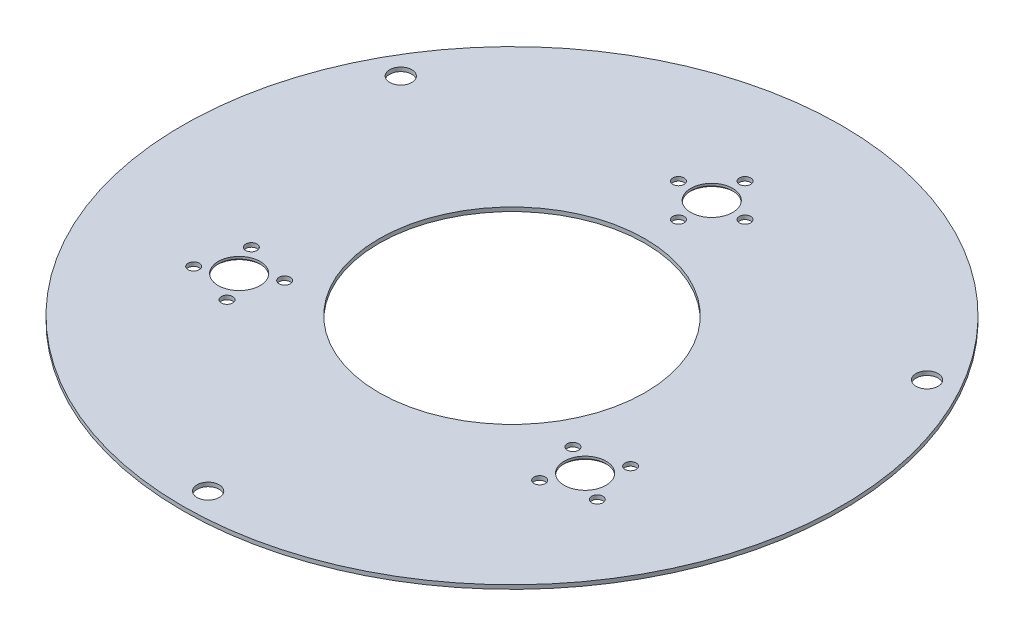
ISO-10303-21;
HEADER;
FILE_DESCRIPTION(('STEP AP214'),'2;1');
FILE_NAME('part.step','',(''),(''),'','','');
FILE_SCHEMA(('AUTOMOTIVE_DESIGN { 1 0 10303 214 1 1 1 1 }'));
ENDSEC;
DATA;
#1=APPLICATION_CONTEXT('core data for automotive mechanical design processes');
#2=APPLICATION_PROTOCOL_DEFINITION('international standard','automotive_design',2000,#1);
#3=PRODUCT_CONTEXT('',#1,'mechanical');
#4=PRODUCT('Part','Part','',(#3));
#5=PRODUCT_RELATED_PRODUCT_CATEGORY('part','',(#4));
#6=PRODUCT_DEFINITION_FORMATION('','',#4);
#7=PRODUCT_DEFINITION_CONTEXT('part definition',#1,'design');
#8=PRODUCT_DEFINITION('design','',#6,#7);
#9=PRODUCT_DEFINITION_SHAPE('','',#8);
#10=(LENGTH_UNIT() NAMED_UNIT(*) SI_UNIT(.MILLI.,.METRE.));
#11=(NAMED_UNIT(*) PLANE_ANGLE_UNIT() SI_UNIT($,.RADIAN.));
#12=(NAMED_UNIT(*) SI_UNIT($,.STERADIAN.) SOLID_ANGLE_UNIT());
#13=UNCERTAINTY_MEASURE_WITH_UNIT(LENGTH_MEASURE(1.E-05),#10,'distance_accuracy_value','');
#14=(GEOMETRIC_REPRESENTATION_CONTEXT(3) GLOBAL_UNCERTAINTY_ASSIGNED_CONTEXT((#13)) GLOBAL_UNIT_ASSIGNED_CONTEXT((#10,
#11,#12)) REPRESENTATION_CONTEXT('',''));
#15=CARTESIAN_POINT('',(0.,0.,0.));
#16=DIRECTION('',(0.,0.,1.));
#17=DIRECTION('',(1.,0.,0.));
#18=AXIS2_PLACEMENT_3D('',#15,#16,#17);
#19=CARTESIAN_POINT('',(0.,0.,0.));
#20=DIRECTION('',(0.,1.,0.));
#21=DIRECTION('',(0.,0.,1.));
#22=AXIS2_PLACEMENT_3D('',#19,#20,#21);
#23=PLANE('',#22);
#24=CARTESIAN_POINT('',(76.9896583964357,0.,44.4500000000014));
#25=DIRECTION('',(0.,-1.,0.));
#26=DIRECTION('',(0.,0.,-1.));
#27=AXIS2_PLACEMENT_3D('',#24,#25,#26);
#28=CIRCLE('',#27,2.15265000000001);
#29=CARTESIAN_POINT('',(76.9896583964357,0.,42.2973500000014));
#30=VERTEX_POINT('',#29);
#31=EDGE_CURVE('E174',#30,#30,#28,.T.);
#32=ORIENTED_EDGE('',*,*,#31,.F.);
#33=EDGE_LOOP('',(#32));
#34=FACE_BOUND('',#33,.T.);
#35=CARTESIAN_POINT('',(-12.6999999999989,0.,-76.2000000000001));
#36=DIRECTION('',(0.,-1.,0.));
#37=DIRECTION('',(0.,0.,-1.));
#38=AXIS2_PLACEMENT_3D('',#35,#36,#37);
#39=CIRCLE('',#38,2.15265);
#40=CARTESIAN_POINT('',(-12.6999999999989,0.,-78.3526500000001));
#41=VERTEX_POINT('',#40);
#42=EDGE_CURVE('E162',#41,#41,#39,.T.);
#43=ORIENTED_EDGE('',*,*,#42,.F.);
#44=EDGE_LOOP('',(#43));
#45=FACE_BOUND('',#44,.T.);
#46=CARTESIAN_POINT('',(12.7000000000011,0.,-76.1999999999999));
#47=DIRECTION('',(0.,-1.,0.));
#48=DIRECTION('',(0.,0.,-1.));
#49=AXIS2_PLACEMENT_3D('',#46,#47,#48);
#50=CIRCLE('',#49,2.15265);
#51=CARTESIAN_POINT('',(12.7000000000011,0.,-78.3526499999999));
#52=VERTEX_POINT('',#51);
#53=EDGE_CURVE('E150',#52,#52,#50,.T.);
#54=ORIENTED_EDGE('',*,*,#53,.F.);
#55=EDGE_LOOP('',(#54));
#56=FACE_BOUND('',#55,.T.);
#57=CARTESIAN_POINT('',(8.74300631892311E-13,0.,-63.5));
#58=DIRECTION('',(0.,-1.,0.));
#59=DIRECTION('',(0.,0.,-1.));
#60=AXIS2_PLACEMENT_3D('',#57,#58,#59);
#61=CIRCLE('',#60,2.15265);
#62=CARTESIAN_POINT('',(8.74300631892311E-13,0.,-65.65265));
#63=VERTEX_POINT('',#62);
#64=EDGE_CURVE('E138',#63,#63,#61,.T.);
#65=ORIENTED_EDGE('',*,*,#64,.F.);
#66=EDGE_LOOP('',(#65));
#67=FACE_BOUND('',#66,.T.);
#68=CARTESIAN_POINT('',(-72.3411357683745,0.,27.101477371937));
#69=DIRECTION('',(0.,-1.,0.));
#70=DIRECTION('',(0.,0.,-1.));
#71=AXIS2_PLACEMENT_3D('',#68,#69,#70);
#72=CIRCLE('',#71,2.15265000000001);
#73=CARTESIAN_POINT('',(-72.3411357683745,0.,24.948827371937));
#74=VERTEX_POINT('',#73);
#75=EDGE_CURVE('E120',#74,#74,#72,.T.);
#76=ORIENTED_EDGE('',*,*,#75,.F.);
#77=EDGE_LOOP('',(#76));
#78=FACE_BOUND('',#77,.T.);
#79=CARTESIAN_POINT('',(-54.9926131403121,0.,31.7499999999995));
#80=DIRECTION('',(0.,-1.,0.));
#81=DIRECTION('',(0.,0.,-1.));
#82=AXIS2_PLACEMENT_3D('',#79,#80,#81);
#83=CIRCLE('',#82,2.15265);
#84=CARTESIAN_POINT('',(-54.9926131403121,0.,29.5973499999995));
#85=VERTEX_POINT('',#84);
#86=EDGE_CURVE('E114',#85,#85,#83,.T.);
#87=ORIENTED_EDGE('',*,*,#86,.F.);
#88=EDGE_LOOP('',(#87));
#89=FACE_BOUND('',#88,.T.);
#90=CARTESIAN_POINT('',(-65.9911357683746,0.,38.0999999999994));
#91=DIRECTION('',(0.,1.,0.));
#92=DIRECTION('',(0.,0.,1.));
#93=AXIS2_PLACEMENT_3D('',#90,#91,#92);
#94=CIRCLE('',#93,8.62330000000003);
#95=CARTESIAN_POINT('',(-65.9911357683746,0.,46.7232999999994));
#96=VERTEX_POINT('',#95);
#97=EDGE_CURVE('E61',#96,#96,#94,.T.);
#98=ORIENTED_EDGE('',*,*,#97,.T.);
#99=EDGE_LOOP('',(#98));
#100=FACE_BOUND('',#99,.T.);
#101=CARTESIAN_POINT('',(0.,0.,-76.2));
#102=DIRECTION('',(0.,1.,0.));
#103=DIRECTION('',(0.,0.,1.));
#104=AXIS2_PLACEMENT_3D('',#101,#102,#103);
#105=CIRCLE('',#104,8.6233);
#106=CARTESIAN_POINT('',(0.,0.,-67.5767));
#107=VERTEX_POINT('',#106);
#108=EDGE_CURVE('E66',#107,#107,#105,.T.);
#109=ORIENTED_EDGE('',*,*,#108,.T.);
#110=EDGE_LOOP('',(#109));
#111=FACE_BOUND('',#110,.T.);
#112=CARTESIAN_POINT('',(65.9911357683741,0.,38.1000000000003));
#113=DIRECTION('',(0.,1.,0.));
#114=DIRECTION('',(0.,0.,1.));
#115=AXIS2_PLACEMENT_3D('',#112,#113,#114);
#116=CIRCLE('',#115,8.62330000000003);
#117=CARTESIAN_POINT('',(65.9911357683741,0.,46.7233000000003));
#118=VERTEX_POINT('',#117);
#119=EDGE_CURVE('E69',#118,#118,#116,.T.);
#120=ORIENTED_EDGE('',*,*,#119,.T.);
#121=EDGE_LOOP('',(#120));
#122=FACE_BOUND('',#121,.T.);
#123=CARTESIAN_POINT('',(100.394514548954,0.,-57.9627999999991));
#124=DIRECTION('',(0.,1.,0.));
#125=DIRECTION('',(0.,0.,1.));
#126=AXIS2_PLACEMENT_3D('',#123,#124,#125);
#127=CIRCLE('',#126,4.21639999999999);
#128=CARTESIAN_POINT('',(100.394514548954,0.,-53.7463999999991));
#129=VERTEX_POINT('',#128);
#130=EDGE_CURVE('E96',#129,#129,#127,.T.);
#131=ORIENTED_EDGE('',*,*,#130,.T.);
#132=EDGE_LOOP('',(#131));
#133=FACE_BOUND('',#132,.T.);
#134=CARTESIAN_POINT('',(-100.394514548953,0.,-57.9628000000005));
#135=DIRECTION('',(0.,1.,0.));
#136=DIRECTION('',(0.,0.,1.));
#137=AXIS2_PLACEMENT_3D('',#134,#135,#136);
#138=CIRCLE('',#137,4.21639999999999);
#139=CARTESIAN_POINT('',(-100.394514548953,0.,-53.7464000000005));
#140=VERTEX_POINT('',#139);
#141=EDGE_CURVE('E90',#140,#140,#138,.T.);
#142=ORIENTED_EDGE('',*,*,#141,.T.);
#143=EDGE_LOOP('',(#142));
#144=FACE_BOUND('',#143,.T.);
#145=CARTESIAN_POINT('',(0.,0.,115.9256));
#146=DIRECTION('',(0.,1.,0.));
#147=DIRECTION('',(0.,0.,1.));
#148=AXIS2_PLACEMENT_3D('',#145,#146,#147);
#149=CIRCLE('',#148,4.2164);
#150=CARTESIAN_POINT('',(0.,0.,120.142));
#151=VERTEX_POINT('',#150);
#152=EDGE_CURVE('E82',#151,#151,#149,.T.);
#153=ORIENTED_EDGE('',*,*,#152,.T.);
#154=EDGE_LOOP('',(#153));
#155=FACE_BOUND('',#154,.T.);
#156=CARTESIAN_POINT('',(0.,0.,0.));
#157=DIRECTION('',(0.,1.,0.));
#158=DIRECTION('',(0.,0.,1.));
#159=AXIS2_PLACEMENT_3D('',#156,#157,#158);
#160=CIRCLE('',#159,125.73);
#161=CARTESIAN_POINT('',(0.,0.,125.73));
#162=VERTEX_POINT('',#161);
#163=EDGE_CURVE('E73',#162,#162,#160,.T.);
#164=ORIENTED_EDGE('',*,*,#163,.F.);
#165=EDGE_LOOP('',(#164));
#166=FACE_BOUND('',#165,.T.);
#167=CARTESIAN_POINT('',(0.,0.,0.));
#168=DIRECTION('',(0.,1.,0.));
#169=DIRECTION('',(0.,0.,1.));
#170=AXIS2_PLACEMENT_3D('',#167,#168,#169);
#171=CIRCLE('',#170,50.8);
#172=CARTESIAN_POINT('',(0.,0.,50.8));
#173=VERTEX_POINT('',#172);
#174=EDGE_CURVE('E79',#173,#173,#171,.T.);
#175=ORIENTED_EDGE('',*,*,#174,.T.);
#176=EDGE_LOOP('',(#175));
#177=FACE_BOUND('',#176,.T.);
#178=CARTESIAN_POINT('',(-76.989658396437,0.,44.4499999999993));
#179=DIRECTION('',(0.,-1.,0.));
#180=DIRECTION('',(0.,0.,-1.));
#181=AXIS2_PLACEMENT_3D('',#178,#179,#180);
#182=CIRCLE('',#181,2.15265000000001);
#183=CARTESIAN_POINT('',(-76.989658396437,0.,42.2973499999993));
#184=VERTEX_POINT('',#183);
#185=EDGE_CURVE('E126',#184,#184,#182,.T.);
#186=ORIENTED_EDGE('',*,*,#185,.F.);
#187=EDGE_LOOP('',(#186));
#188=FACE_BOUND('',#187,.T.);
#189=CARTESIAN_POINT('',(-59.6411357683746,0.,49.0985226280617));
#190=DIRECTION('',(0.,-1.,0.));
#191=DIRECTION('',(0.,0.,-1.));
#192=AXIS2_PLACEMENT_3D('',#189,#190,#191);
#193=CIRCLE('',#192,2.15265);
#194=CARTESIAN_POINT('',(-59.6411357683746,0.,46.9458726280617));
#195=VERTEX_POINT('',#194);
#196=EDGE_CURVE('E132',#195,#195,#193,.T.);
#197=ORIENTED_EDGE('',*,*,#196,.F.);
#198=EDGE_LOOP('',(#197));
#199=FACE_BOUND('',#198,.T.);
#200=CARTESIAN_POINT('',(54.9926131403113,0.,31.750000000001));
#201=DIRECTION('',(0.,-1.,0.));
#202=DIRECTION('',(0.,0.,-1.));
#203=AXIS2_PLACEMENT_3D('',#200,#201,#202);
#204=CIRCLE('',#203,2.15265);
#205=CARTESIAN_POINT('',(54.9926131403113,0.,29.597350000001));
#206=VERTEX_POINT('',#205);
#207=EDGE_CURVE('E144',#206,#206,#204,.T.);
#208=ORIENTED_EDGE('',*,*,#207,.F.);
#209=EDGE_LOOP('',(#208));
#210=FACE_BOUND('',#209,.T.);
#211=CARTESIAN_POINT('',(1.23512311489549E-12,0.,-88.9));
#212=DIRECTION('',(0.,-1.,0.));
#213=DIRECTION('',(0.,0.,-1.));
#214=AXIS2_PLACEMENT_3D('',#211,#212,#213);
#215=CIRCLE('',#214,2.15265);
#216=CARTESIAN_POINT('',(1.23512311489549E-12,0.,-91.05265));
#217=VERTEX_POINT('',#216);
#218=EDGE_CURVE('E156',#217,#217,#215,.T.);
#219=ORIENTED_EDGE('',*,*,#218,.F.);
#220=EDGE_LOOP('',(#219));
#221=FACE_BOUND('',#220,.T.);
#222=CARTESIAN_POINT('',(59.6411357683733,0.,49.0985226280635));
#223=DIRECTION('',(0.,-1.,0.));
#224=DIRECTION('',(0.,0.,-1.));
#225=AXIS2_PLACEMENT_3D('',#222,#223,#224);
#226=CIRCLE('',#225,2.15265);
#227=CARTESIAN_POINT('',(59.6411357683733,0.,46.9458726280635));
#228=VERTEX_POINT('',#227);
#229=EDGE_CURVE('E168',#228,#228,#226,.T.);
#230=ORIENTED_EDGE('',*,*,#229,.F.);
#231=EDGE_LOOP('',(#230));
#232=FACE_BOUND('',#231,.T.);
#233=CARTESIAN_POINT('',(72.3411357683736,0.,27.1014773719389));
#234=DIRECTION('',(0.,-1.,0.));
#235=DIRECTION('',(0.,0.,-1.));
#236=AXIS2_PLACEMENT_3D('',#233,#234,#235);
#237=CIRCLE('',#236,2.15265000000001);
#238=CARTESIAN_POINT('',(72.3411357683736,0.,24.9488273719389));
#239=VERTEX_POINT('',#238);
#240=EDGE_CURVE('E180',#239,#239,#237,.T.);
#241=ORIENTED_EDGE('',*,*,#240,.F.);
#242=EDGE_LOOP('',(#241));
#243=FACE_BOUND('',#242,.T.);
#244=ADVANCED_FACE('F46',(#34,#45,#56,#67,#78,#89,#100,#111,#122,#133,#144,#155,#166,#177,#188,
#199,#210,#221,#232,#243),#23,.F.);
#245=CARTESIAN_POINT('',(0.,1.524,0.));
#246=DIRECTION('',(0.,1.,0.));
#247=DIRECTION('',(0.,0.,1.));
#248=AXIS2_PLACEMENT_3D('',#245,#246,#247);
#249=PLANE('',#248);
#250=CARTESIAN_POINT('',(76.9896583964357,1.524,44.4500000000014));
#251=DIRECTION('',(0.,-1.,0.));
#252=DIRECTION('',(0.,0.,-1.));
#253=AXIS2_PLACEMENT_3D('',#250,#251,#252);
#254=CIRCLE('',#253,2.15265000000001);
#255=CARTESIAN_POINT('',(76.9896583964357,1.524,42.2973500000014));
#256=VERTEX_POINT('',#255);
#257=EDGE_CURVE('E171',#256,#256,#254,.T.);
#258=ORIENTED_EDGE('',*,*,#257,.T.);
#259=EDGE_LOOP('',(#258));
#260=FACE_BOUND('',#259,.T.);
#261=CARTESIAN_POINT('',(-12.6999999999989,1.524,-76.2000000000001));
#262=DIRECTION('',(0.,-1.,0.));
#263=DIRECTION('',(0.,0.,-1.));
#264=AXIS2_PLACEMENT_3D('',#261,#262,#263);
#265=CIRCLE('',#264,2.15265);
#266=CARTESIAN_POINT('',(-12.6999999999989,1.524,-78.3526500000001));
#267=VERTEX_POINT('',#266);
#268=EDGE_CURVE('E159',#267,#267,#265,.T.);
#269=ORIENTED_EDGE('',*,*,#268,.T.);
#270=EDGE_LOOP('',(#269));
#271=FACE_BOUND('',#270,.T.);
#272=CARTESIAN_POINT('',(12.7000000000011,1.524,-76.1999999999999));
#273=DIRECTION('',(0.,-1.,0.));
#274=DIRECTION('',(0.,0.,-1.));
#275=AXIS2_PLACEMENT_3D('',#272,#273,#274);
#276=CIRCLE('',#275,2.15265);
#277=CARTESIAN_POINT('',(12.7000000000011,1.524,-78.3526499999999));
#278=VERTEX_POINT('',#277);
#279=EDGE_CURVE('E147',#278,#278,#276,.T.);
#280=ORIENTED_EDGE('',*,*,#279,.T.);
#281=EDGE_LOOP('',(#280));
#282=FACE_BOUND('',#281,.T.);
#283=CARTESIAN_POINT('',(8.74300631892311E-13,1.524,-63.5));
#284=DIRECTION('',(0.,-1.,0.));
#285=DIRECTION('',(0.,0.,-1.));
#286=AXIS2_PLACEMENT_3D('',#283,#284,#285);
#287=CIRCLE('',#286,2.15265);
#288=CARTESIAN_POINT('',(8.74300631892311E-13,1.524,-65.65265));
#289=VERTEX_POINT('',#288);
#290=EDGE_CURVE('E135',#289,#289,#287,.T.);
#291=ORIENTED_EDGE('',*,*,#290,.T.);
#292=EDGE_LOOP('',(#291));
#293=FACE_BOUND('',#292,.T.);
#294=CARTESIAN_POINT('',(0.,1.524,0.));
#295=DIRECTION('',(0.,1.,0.));
#296=DIRECTION('',(0.,0.,1.));
#297=AXIS2_PLACEMENT_3D('',#294,#295,#296);
#298=CIRCLE('',#297,50.8);
#299=CARTESIAN_POINT('',(0.,1.524,50.8));
#300=VERTEX_POINT('',#299);
#301=EDGE_CURVE('E76',#300,#300,#298,.T.);
#302=ORIENTED_EDGE('',*,*,#301,.F.);
#303=EDGE_LOOP('',(#302));
#304=FACE_BOUND('',#303,.T.);
#305=CARTESIAN_POINT('',(0.,1.524,0.));
#306=DIRECTION('',(0.,1.,0.));
#307=DIRECTION('',(0.,0.,1.));
#308=AXIS2_PLACEMENT_3D('',#305,#306,#307);
#309=CIRCLE('',#308,125.73);
#310=CARTESIAN_POINT('',(0.,1.524,125.73));
#311=VERTEX_POINT('',#310);
#312=EDGE_CURVE('E72',#311,#311,#309,.T.);
#313=ORIENTED_EDGE('',*,*,#312,.T.);
#314=EDGE_LOOP('',(#313));
#315=FACE_BOUND('',#314,.T.);
#316=CARTESIAN_POINT('',(0.,1.524,115.9256));
#317=DIRECTION('',(0.,1.,0.));
#318=DIRECTION('',(0.,0.,1.));
#319=AXIS2_PLACEMENT_3D('',#316,#317,#318);
#320=CIRCLE('',#319,4.21639999999999);
#321=CARTESIAN_POINT('',(0.,1.524,120.142));
#322=VERTEX_POINT('',#321);
#323=EDGE_CURVE('E87',#322,#322,#320,.T.);
#324=ORIENTED_EDGE('',*,*,#323,.F.);
#325=EDGE_LOOP('',(#324));
#326=FACE_BOUND('',#325,.T.);
#327=CARTESIAN_POINT('',(-100.394514548953,1.524,-57.9628000000005));
#328=DIRECTION('',(0.,1.,0.));
#329=DIRECTION('',(0.,0.,1.));
#330=AXIS2_PLACEMENT_3D('',#327,#328,#329);
#331=CIRCLE('',#330,4.21639999999998);
#332=CARTESIAN_POINT('',(-100.394514548953,1.524,-53.7464000000005));
#333=VERTEX_POINT('',#332);
#334=EDGE_CURVE('E93',#333,#333,#331,.T.);
#335=ORIENTED_EDGE('',*,*,#334,.F.);
#336=EDGE_LOOP('',(#335));
#337=FACE_BOUND('',#336,.T.);
#338=CARTESIAN_POINT('',(100.394514548954,1.524,-57.9627999999991));
#339=DIRECTION('',(0.,1.,0.));
#340=DIRECTION('',(0.,0.,1.));
#341=AXIS2_PLACEMENT_3D('',#338,#339,#340);
#342=CIRCLE('',#341,4.21639999999999);
#343=CARTESIAN_POINT('',(100.394514548954,1.524,-53.7463999999991));
#344=VERTEX_POINT('',#343);
#345=EDGE_CURVE('E99',#344,#344,#342,.T.);
#346=ORIENTED_EDGE('',*,*,#345,.F.);
#347=EDGE_LOOP('',(#346));
#348=FACE_BOUND('',#347,.T.);
#349=CARTESIAN_POINT('',(0.,1.524,-76.2));
#350=DIRECTION('',(0.,1.,0.));
#351=DIRECTION('',(0.,0.,1.));
#352=AXIS2_PLACEMENT_3D('',#349,#350,#351);
#353=CIRCLE('',#352,7.98830000000001);
#354=CARTESIAN_POINT('',(0.,1.524,-68.2117));
#355=VERTEX_POINT('',#354);
#356=EDGE_CURVE('E102',#355,#355,#353,.T.);
#357=ORIENTED_EDGE('',*,*,#356,.F.);
#358=EDGE_LOOP('',(#357));
#359=FACE_BOUND('',#358,.T.);
#360=CARTESIAN_POINT('',(65.9911357683741,1.524,38.1000000000003));
#361=DIRECTION('',(0.,1.,0.));
#362=DIRECTION('',(0.,0.,1.));
#363=AXIS2_PLACEMENT_3D('',#360,#361,#362);
#364=CIRCLE('',#363,7.98830000000002);
#365=CARTESIAN_POINT('',(65.9911357683741,1.524,46.0883000000003));
#366=VERTEX_POINT('',#365);
#367=EDGE_CURVE('E105',#366,#366,#364,.T.);
#368=ORIENTED_EDGE('',*,*,#367,.F.);
#369=EDGE_LOOP('',(#368));
#370=FACE_BOUND('',#369,.T.);
#371=CARTESIAN_POINT('',(-65.9911357683746,1.524,38.0999999999994));
#372=DIRECTION('',(0.,1.,0.));
#373=DIRECTION('',(0.,0.,1.));
#374=AXIS2_PLACEMENT_3D('',#371,#372,#373);
#375=CIRCLE('',#374,7.98830000000002);
#376=CARTESIAN_POINT('',(-65.9911357683746,1.524,46.0882999999994));
#377=VERTEX_POINT('',#376);
#378=EDGE_CURVE('E108',#377,#377,#375,.T.);
#379=ORIENTED_EDGE('',*,*,#378,.F.);
#380=EDGE_LOOP('',(#379));
#381=FACE_BOUND('',#380,.T.);
#382=CARTESIAN_POINT('',(-54.9926131403121,1.524,31.7499999999995));
#383=DIRECTION('',(0.,-1.,0.));
#384=DIRECTION('',(0.,0.,-1.));
#385=AXIS2_PLACEMENT_3D('',#382,#383,#384);
#386=CIRCLE('',#385,2.15265);
#387=CARTESIAN_POINT('',(-54.9926131403121,1.524,29.5973499999995));
#388=VERTEX_POINT('',#387);
#389=EDGE_CURVE('E111',#388,#388,#386,.T.);
#390=ORIENTED_EDGE('',*,*,#389,.T.);
#391=EDGE_LOOP('',(#390));
#392=FACE_BOUND('',#391,.T.);
#393=CARTESIAN_POINT('',(-72.3411357683745,1.524,27.101477371937));
#394=DIRECTION('',(0.,-1.,0.));
#395=DIRECTION('',(0.,0.,-1.));
#396=AXIS2_PLACEMENT_3D('',#393,#394,#395);
#397=CIRCLE('',#396,2.15265000000001);
#398=CARTESIAN_POINT('',(-72.3411357683745,1.524,24.948827371937));
#399=VERTEX_POINT('',#398);
#400=EDGE_CURVE('E117',#399,#399,#397,.T.);
#401=ORIENTED_EDGE('',*,*,#400,.T.);
#402=EDGE_LOOP('',(#401));
#403=FACE_BOUND('',#402,.T.);
#404=CARTESIAN_POINT('',(-76.989658396437,1.524,44.4499999999993));
#405=DIRECTION('',(0.,-1.,0.));
#406=DIRECTION('',(0.,0.,-1.));
#407=AXIS2_PLACEMENT_3D('',#404,#405,#406);
#408=CIRCLE('',#407,2.15265000000001);
#409=CARTESIAN_POINT('',(-76.989658396437,1.524,42.2973499999993));
#410=VERTEX_POINT('',#409);
#411=EDGE_CURVE('E123',#410,#410,#408,.T.);
#412=ORIENTED_EDGE('',*,*,#411,.T.);
#413=EDGE_LOOP('',(#412));
#414=FACE_BOUND('',#413,.T.);
#415=CARTESIAN_POINT('',(-59.6411357683746,1.524,49.0985226280617));
#416=DIRECTION('',(0.,-1.,0.));
#417=DIRECTION('',(0.,0.,-1.));
#418=AXIS2_PLACEMENT_3D('',#415,#416,#417);
#419=CIRCLE('',#418,2.15265);
#420=CARTESIAN_POINT('',(-59.6411357683746,1.524,46.9458726280617));
#421=VERTEX_POINT('',#420);
#422=EDGE_CURVE('E129',#421,#421,#419,.T.);
#423=ORIENTED_EDGE('',*,*,#422,.T.);
#424=EDGE_LOOP('',(#423));
#425=FACE_BOUND('',#424,.T.);
#426=CARTESIAN_POINT('',(54.9926131403113,1.524,31.750000000001));
#427=DIRECTION('',(0.,-1.,0.));
#428=DIRECTION('',(0.,0.,-1.));
#429=AXIS2_PLACEMENT_3D('',#426,#427,#428);
#430=CIRCLE('',#429,2.15265);
#431=CARTESIAN_POINT('',(54.9926131403113,1.524,29.597350000001));
#432=VERTEX_POINT('',#431);
#433=EDGE_CURVE('E141',#432,#432,#430,.T.);
#434=ORIENTED_EDGE('',*,*,#433,.T.);
#435=EDGE_LOOP('',(#434));
#436=FACE_BOUND('',#435,.T.);
#437=CARTESIAN_POINT('',(1.23512311489549E-12,1.524,-88.9));
#438=DIRECTION('',(0.,-1.,0.));
#439=DIRECTION('',(0.,0.,-1.));
#440=AXIS2_PLACEMENT_3D('',#437,#438,#439);
#441=CIRCLE('',#440,2.15265);
#442=CARTESIAN_POINT('',(1.23512311489549E-12,1.524,-91.05265));
#443=VERTEX_POINT('',#442);
#444=EDGE_CURVE('E153',#443,#443,#441,.T.);
#445=ORIENTED_EDGE('',*,*,#444,.T.);
#446=EDGE_LOOP('',(#445));
#447=FACE_BOUND('',#446,.T.);
#448=CARTESIAN_POINT('',(59.6411357683733,1.524,49.0985226280635));
#449=DIRECTION('',(0.,-1.,0.));
#450=DIRECTION('',(0.,0.,-1.));
#451=AXIS2_PLACEMENT_3D('',#448,#449,#450);
#452=CIRCLE('',#451,2.15265);
#453=CARTESIAN_POINT('',(59.6411357683733,1.524,46.9458726280635));
#454=VERTEX_POINT('',#453);
#455=EDGE_CURVE('E165',#454,#454,#452,.T.);
#456=ORIENTED_EDGE('',*,*,#455,.T.);
#457=EDGE_LOOP('',(#456));
#458=FACE_BOUND('',#457,.T.);
#459=CARTESIAN_POINT('',(72.3411357683736,1.524,27.1014773719389));
#460=DIRECTION('',(0.,-1.,0.));
#461=DIRECTION('',(0.,0.,-1.));
#462=AXIS2_PLACEMENT_3D('',#459,#460,#461);
#463=CIRCLE('',#462,2.15265000000001);
#464=CARTESIAN_POINT('',(72.3411357683736,1.524,24.9488273719389));
#465=VERTEX_POINT('',#464);
#466=EDGE_CURVE('E177',#465,#465,#463,.T.);
#467=ORIENTED_EDGE('',*,*,#466,.T.);
#468=EDGE_LOOP('',(#467));
#469=FACE_BOUND('',#468,.T.);
#470=ADVANCED_FACE('F187',(#260,#271,#282,#293,#304,#315,#326,#337,#348,#359,#370,#381,#392,
#403,#414,#425,#436,#447,#458,#469),#249,.T.);
#471=CARTESIAN_POINT('',(0.,1.524,0.));
#472=DIRECTION('',(0.,-1.,0.));
#473=DIRECTION('',(0.,0.,-1.));
#474=AXIS2_PLACEMENT_3D('',#471,#472,#473);
#475=CYLINDRICAL_SURFACE('',#474,125.73);
#476=ORIENTED_EDGE('',*,*,#312,.F.);
#477=EDGE_LOOP('',(#476));
#478=FACE_BOUND('',#477,.T.);
#479=ORIENTED_EDGE('',*,*,#163,.T.);
#480=EDGE_LOOP('',(#479));
#481=FACE_BOUND('',#480,.T.);
#482=ADVANCED_FACE('F193',(#478,#481),#475,.T.);
#483=CARTESIAN_POINT('',(0.,1.524,0.));
#484=DIRECTION('',(0.,-1.,0.));
#485=DIRECTION('',(0.,0.,-1.));
#486=AXIS2_PLACEMENT_3D('',#483,#484,#485);
#487=CYLINDRICAL_SURFACE('',#486,50.8);
#488=ORIENTED_EDGE('',*,*,#301,.T.);
#489=EDGE_LOOP('',(#488));
#490=FACE_BOUND('',#489,.T.);
#491=ORIENTED_EDGE('',*,*,#174,.F.);
#492=EDGE_LOOP('',(#491));
#493=FACE_BOUND('',#492,.T.);
#494=ADVANCED_FACE('F202',(#490,#493),#487,.F.);
#495=CARTESIAN_POINT('',(0.,1.524,115.9256));
#496=DIRECTION('',(0.,1.,0.));
#497=DIRECTION('',(0.,0.,1.));
#498=AXIS2_PLACEMENT_3D('',#495,#496,#497);
#499=CYLINDRICAL_SURFACE('',#498,4.21639999999999);
#500=ORIENTED_EDGE('',*,*,#152,.F.);
#501=EDGE_LOOP('',(#500));
#502=FACE_BOUND('',#501,.T.);
#503=ORIENTED_EDGE('',*,*,#323,.T.);
#504=EDGE_LOOP('',(#503));
#505=FACE_BOUND('',#504,.T.);
#506=ADVANCED_FACE('F306',(#502,#505),#499,.F.);
#507=CARTESIAN_POINT('',(-100.394514548953,1.524,-57.9628000000005));
#508=DIRECTION('',(0.,1.,0.));
#509=DIRECTION('',(0.,0.,1.));
#510=AXIS2_PLACEMENT_3D('',#507,#508,#509);
#511=CYLINDRICAL_SURFACE('',#510,4.21639999999999);
#512=ORIENTED_EDGE('',*,*,#141,.F.);
#513=EDGE_LOOP('',(#512));
#514=FACE_BOUND('',#513,.T.);
#515=ORIENTED_EDGE('',*,*,#334,.T.);
#516=EDGE_LOOP('',(#515));
#517=FACE_BOUND('',#516,.T.);
#518=ADVANCED_FACE('F302',(#514,#517),#511,.F.);
#519=CARTESIAN_POINT('',(100.394514548954,1.524,-57.9627999999991));
#520=DIRECTION('',(0.,1.,0.));
#521=DIRECTION('',(0.,0.,1.));
#522=AXIS2_PLACEMENT_3D('',#519,#520,#521);
#523=CYLINDRICAL_SURFACE('',#522,4.21639999999999);
#524=ORIENTED_EDGE('',*,*,#130,.F.);
#525=EDGE_LOOP('',(#524));
#526=FACE_BOUND('',#525,.T.);
#527=ORIENTED_EDGE('',*,*,#345,.T.);
#528=EDGE_LOOP('',(#527));
#529=FACE_BOUND('',#528,.T.);
#530=ADVANCED_FACE('F299',(#526,#529),#523,.F.);
#531=CARTESIAN_POINT('',(0.,1.524,-76.2));
#532=DIRECTION('',(0.,1.,0.));
#533=DIRECTION('',(0.,0.,1.));
#534=AXIS2_PLACEMENT_3D('',#531,#532,#533);
#535=CYLINDRICAL_SURFACE('',#534,7.98830000000001);
#536=CARTESIAN_POINT('',(0.,0.63499999999996,-76.2));
#537=DIRECTION('',(0.,1.,0.));
#538=DIRECTION('',(0.,0.,1.));
#539=AXIS2_PLACEMENT_3D('',#536,#537,#538);
#540=CIRCLE('',#539,7.98830000000001);
#541=CARTESIAN_POINT('',(0.,0.63499999999996,-68.2117));
#542=VERTEX_POINT('',#541);
#543=EDGE_CURVE('E53',#542,#542,#540,.F.);
#544=ORIENTED_EDGE('',*,*,#543,.T.);
#545=EDGE_LOOP('',(#544));
#546=FACE_BOUND('',#545,.T.);
#547=ORIENTED_EDGE('',*,*,#356,.T.);
#548=EDGE_LOOP('',(#547));
#549=FACE_BOUND('',#548,.T.);
#550=ADVANCED_FACE('F296',(#546,#549),#535,.F.);
#551=CARTESIAN_POINT('',(65.9911357683741,1.524,38.1000000000003));
#552=DIRECTION('',(0.,1.,0.));
#553=DIRECTION('',(0.,0.,1.));
#554=AXIS2_PLACEMENT_3D('',#551,#552,#553);
#555=CYLINDRICAL_SURFACE('',#554,7.98830000000001);
#556=CARTESIAN_POINT('',(65.9911357683741,0.635000000000014,38.1000000000003));
#557=DIRECTION('',(0.,1.,0.));
#558=DIRECTION('',(0.,0.,1.));
#559=AXIS2_PLACEMENT_3D('',#556,#557,#558);
#560=CIRCLE('',#559,7.98830000000001);
#561=CARTESIAN_POINT('',(65.9911357683741,0.635000000000014,46.0883000000003));
#562=VERTEX_POINT('',#561);
#563=EDGE_CURVE('E12',#562,#562,#560,.F.);
#564=ORIENTED_EDGE('',*,*,#563,.T.);
#565=EDGE_LOOP('',(#564));
#566=FACE_BOUND('',#565,.T.);
#567=ORIENTED_EDGE('',*,*,#367,.T.);
#568=EDGE_LOOP('',(#567));
#569=FACE_BOUND('',#568,.T.);
#570=ADVANCED_FACE('F292',(#566,#569),#555,.F.);
#571=CARTESIAN_POINT('',(-65.9911357683746,1.524,38.0999999999994));
#572=DIRECTION('',(0.,1.,0.));
#573=DIRECTION('',(0.,0.,1.));
#574=AXIS2_PLACEMENT_3D('',#571,#572,#573);
#575=CYLINDRICAL_SURFACE('',#574,7.98830000000001);
#576=CARTESIAN_POINT('',(-65.9911357683746,0.635000000000009,38.0999999999994));
#577=DIRECTION('',(0.,1.,0.));
#578=DIRECTION('',(0.,0.,1.));
#579=AXIS2_PLACEMENT_3D('',#576,#577,#578);
#580=CIRCLE('',#579,7.98830000000001);
#581=CARTESIAN_POINT('',(-65.9911357683746,0.635000000000009,46.0882999999994));
#582=VERTEX_POINT('',#581);
#583=EDGE_CURVE('E57',#582,#582,#580,.F.);
#584=ORIENTED_EDGE('',*,*,#583,.T.);
#585=EDGE_LOOP('',(#584));
#586=FACE_BOUND('',#585,.T.);
#587=ORIENTED_EDGE('',*,*,#378,.T.);
#588=EDGE_LOOP('',(#587));
#589=FACE_BOUND('',#588,.T.);
#590=ADVANCED_FACE('F207',(#586,#589),#575,.F.);
#591=CARTESIAN_POINT('',(-65.9911357683746,0.,38.0999999999994));
#592=DIRECTION('',(0.,-1.,0.));
#593=DIRECTION('',(0.,0.,-1.));
#594=AXIS2_PLACEMENT_3D('',#591,#592,#593);
#595=CONICAL_SURFACE('',#594,8.62330000000003,0.785398163397452);
#596=ORIENTED_EDGE('',*,*,#583,.F.);
#597=EDGE_LOOP('',(#596));
#598=FACE_BOUND('',#597,.T.);
#599=ORIENTED_EDGE('',*,*,#97,.F.);
#600=EDGE_LOOP('',(#599));
#601=FACE_BOUND('',#600,.T.);
#602=ADVANCED_FACE('F204',(#598,#601),#595,.F.);
#603=CARTESIAN_POINT('',(0.,0.,-76.2));
#604=DIRECTION('',(0.,-1.,0.));
#605=DIRECTION('',(0.,0.,-1.));
#606=AXIS2_PLACEMENT_3D('',#603,#604,#605);
#607=CONICAL_SURFACE('',#606,8.6233,0.78539816339747);
#608=ORIENTED_EDGE('',*,*,#543,.F.);
#609=EDGE_LOOP('',(#608));
#610=FACE_BOUND('',#609,.T.);
#611=ORIENTED_EDGE('',*,*,#108,.F.);
#612=EDGE_LOOP('',(#611));
#613=FACE_BOUND('',#612,.T.);
#614=ADVANCED_FACE('F206',(#610,#613),#607,.F.);
#615=CARTESIAN_POINT('',(65.9911357683741,0.,38.1000000000003));
#616=DIRECTION('',(0.,-1.,0.));
#617=DIRECTION('',(0.,0.,-1.));
#618=AXIS2_PLACEMENT_3D('',#615,#616,#617);
#619=CONICAL_SURFACE('',#618,8.62330000000003,0.785398163397451);
#620=ORIENTED_EDGE('',*,*,#563,.F.);
#621=EDGE_LOOP('',(#620));
#622=FACE_BOUND('',#621,.T.);
#623=ORIENTED_EDGE('',*,*,#119,.F.);
#624=EDGE_LOOP('',(#623));
#625=FACE_BOUND('',#624,.T.);
#626=ADVANCED_FACE('F48',(#622,#625),#619,.F.);
#627=CARTESIAN_POINT('',(-54.9926131403121,0.,31.7499999999995));
#628=DIRECTION('',(0.,-1.,0.));
#629=DIRECTION('',(0.,0.,-1.));
#630=AXIS2_PLACEMENT_3D('',#627,#628,#629);
#631=CYLINDRICAL_SURFACE('',#630,2.15265);
#632=ORIENTED_EDGE('',*,*,#389,.F.);
#633=EDGE_LOOP('',(#632));
#634=FACE_BOUND('',#633,.T.);
#635=ORIENTED_EDGE('',*,*,#86,.T.);
#636=EDGE_LOOP('',(#635));
#637=FACE_BOUND('',#636,.T.);
#638=ADVANCED_FACE('F214',(#634,#637),#631,.F.);
#639=CARTESIAN_POINT('',(-72.3411357683745,0.,27.101477371937));
#640=DIRECTION('',(0.,-1.,0.));
#641=DIRECTION('',(0.,0.,-1.));
#642=AXIS2_PLACEMENT_3D('',#639,#640,#641);
#643=CYLINDRICAL_SURFACE('',#642,2.15265000000001);
#644=ORIENTED_EDGE('',*,*,#400,.F.);
#645=EDGE_LOOP('',(#644));
#646=FACE_BOUND('',#645,.T.);
#647=ORIENTED_EDGE('',*,*,#75,.T.);
#648=EDGE_LOOP('',(#647));
#649=FACE_BOUND('',#648,.T.);
#650=ADVANCED_FACE('F282',(#646,#649),#643,.F.);
#651=CARTESIAN_POINT('',(-76.989658396437,0.,44.4499999999993));
#652=DIRECTION('',(0.,-1.,0.));
#653=DIRECTION('',(0.,0.,-1.));
#654=AXIS2_PLACEMENT_3D('',#651,#652,#653);
#655=CYLINDRICAL_SURFACE('',#654,2.15265000000001);
#656=ORIENTED_EDGE('',*,*,#411,.F.);
#657=EDGE_LOOP('',(#656));
#658=FACE_BOUND('',#657,.T.);
#659=ORIENTED_EDGE('',*,*,#185,.T.);
#660=EDGE_LOOP('',(#659));
#661=FACE_BOUND('',#660,.T.);
#662=ADVANCED_FACE('F278',(#658,#661),#655,.F.);
#663=CARTESIAN_POINT('',(-59.6411357683746,0.,49.0985226280617));
#664=DIRECTION('',(0.,-1.,0.));
#665=DIRECTION('',(0.,0.,-1.));
#666=AXIS2_PLACEMENT_3D('',#663,#664,#665);
#667=CYLINDRICAL_SURFACE('',#666,2.15265);
#668=ORIENTED_EDGE('',*,*,#422,.F.);
#669=EDGE_LOOP('',(#668));
#670=FACE_BOUND('',#669,.T.);
#671=ORIENTED_EDGE('',*,*,#196,.T.);
#672=EDGE_LOOP('',(#671));
#673=FACE_BOUND('',#672,.T.);
#674=ADVANCED_FACE('F274',(#670,#673),#667,.F.);
#675=CARTESIAN_POINT('',(8.74300631892311E-13,0.,-63.5));
#676=DIRECTION('',(0.,-1.,0.));
#677=DIRECTION('',(0.,0.,-1.));
#678=AXIS2_PLACEMENT_3D('',#675,#676,#677);
#679=CYLINDRICAL_SURFACE('',#678,2.15265);
#680=ORIENTED_EDGE('',*,*,#290,.F.);
#681=EDGE_LOOP('',(#680));
#682=FACE_BOUND('',#681,.T.);
#683=ORIENTED_EDGE('',*,*,#64,.T.);
#684=EDGE_LOOP('',(#683));
#685=FACE_BOUND('',#684,.T.);
#686=ADVANCED_FACE('F270',(#682,#685),#679,.F.);
#687=CARTESIAN_POINT('',(54.9926131403113,0.,31.750000000001));
#688=DIRECTION('',(0.,-1.,0.));
#689=DIRECTION('',(0.,0.,-1.));
#690=AXIS2_PLACEMENT_3D('',#687,#688,#689);
#691=CYLINDRICAL_SURFACE('',#690,2.15265);
#692=ORIENTED_EDGE('',*,*,#433,.F.);
#693=EDGE_LOOP('',(#692));
#694=FACE_BOUND('',#693,.T.);
#695=ORIENTED_EDGE('',*,*,#207,.T.);
#696=EDGE_LOOP('',(#695));
#697=FACE_BOUND('',#696,.T.);
#698=ADVANCED_FACE('F266',(#694,#697),#691,.F.);
#699=CARTESIAN_POINT('',(12.7000000000011,0.,-76.1999999999999));
#700=DIRECTION('',(0.,-1.,0.));
#701=DIRECTION('',(0.,0.,-1.));
#702=AXIS2_PLACEMENT_3D('',#699,#700,#701);
#703=CYLINDRICAL_SURFACE('',#702,2.15265);
#704=ORIENTED_EDGE('',*,*,#279,.F.);
#705=EDGE_LOOP('',(#704));
#706=FACE_BOUND('',#705,.T.);
#707=ORIENTED_EDGE('',*,*,#53,.T.);
#708=EDGE_LOOP('',(#707));
#709=FACE_BOUND('',#708,.T.);
#710=ADVANCED_FACE('F262',(#706,#709),#703,.F.);
#711=CARTESIAN_POINT('',(1.23512311489549E-12,0.,-88.9));
#712=DIRECTION('',(0.,-1.,0.));
#713=DIRECTION('',(0.,0.,-1.));
#714=AXIS2_PLACEMENT_3D('',#711,#712,#713);
#715=CYLINDRICAL_SURFACE('',#714,2.15265);
#716=ORIENTED_EDGE('',*,*,#444,.F.);
#717=EDGE_LOOP('',(#716));
#718=FACE_BOUND('',#717,.T.);
#719=ORIENTED_EDGE('',*,*,#218,.T.);
#720=EDGE_LOOP('',(#719));
#721=FACE_BOUND('',#720,.T.);
#722=ADVANCED_FACE('F254',(#718,#721),#715,.F.);
#723=CARTESIAN_POINT('',(-12.6999999999989,0.,-76.2000000000001));
#724=DIRECTION('',(0.,-1.,0.));
#725=DIRECTION('',(0.,0.,-1.));
#726=AXIS2_PLACEMENT_3D('',#723,#724,#725);
#727=CYLINDRICAL_SURFACE('',#726,2.15265);
#728=ORIENTED_EDGE('',*,*,#268,.F.);
#729=EDGE_LOOP('',(#728));
#730=FACE_BOUND('',#729,.T.);
#731=ORIENTED_EDGE('',*,*,#42,.T.);
#732=EDGE_LOOP('',(#731));
#733=FACE_BOUND('',#732,.T.);
#734=ADVANCED_FACE('F245',(#730,#733),#727,.F.);
#735=CARTESIAN_POINT('',(59.6411357683733,0.,49.0985226280635));
#736=DIRECTION('',(0.,-1.,0.));
#737=DIRECTION('',(0.,0.,-1.));
#738=AXIS2_PLACEMENT_3D('',#735,#736,#737);
#739=CYLINDRICAL_SURFACE('',#738,2.15265);
#740=ORIENTED_EDGE('',*,*,#455,.F.);
#741=EDGE_LOOP('',(#740));
#742=FACE_BOUND('',#741,.T.);
#743=ORIENTED_EDGE('',*,*,#229,.T.);
#744=EDGE_LOOP('',(#743));
#745=FACE_BOUND('',#744,.T.);
#746=ADVANCED_FACE('F242',(#742,#745),#739,.F.);
#747=CARTESIAN_POINT('',(76.9896583964357,0.,44.4500000000014));
#748=DIRECTION('',(0.,-1.,0.));
#749=DIRECTION('',(0.,0.,-1.));
#750=AXIS2_PLACEMENT_3D('',#747,#748,#749);
#751=CYLINDRICAL_SURFACE('',#750,2.15265000000001);
#752=ORIENTED_EDGE('',*,*,#257,.F.);
#753=EDGE_LOOP('',(#752));
#754=FACE_BOUND('',#753,.T.);
#755=ORIENTED_EDGE('',*,*,#31,.T.);
#756=EDGE_LOOP('',(#755));
#757=FACE_BOUND('',#756,.T.);
#758=ADVANCED_FACE('F244',(#754,#757),#751,.F.);
#759=CARTESIAN_POINT('',(72.3411357683736,0.,27.1014773719389));
#760=DIRECTION('',(0.,-1.,0.));
#761=DIRECTION('',(0.,0.,-1.));
#762=AXIS2_PLACEMENT_3D('',#759,#760,#761);
#763=CYLINDRICAL_SURFACE('',#762,2.15265000000001);
#764=ORIENTED_EDGE('',*,*,#466,.F.);
#765=EDGE_LOOP('',(#764));
#766=FACE_BOUND('',#765,.T.);
#767=ORIENTED_EDGE('',*,*,#240,.T.);
#768=EDGE_LOOP('',(#767));
#769=FACE_BOUND('',#768,.T.);
#770=ADVANCED_FACE('F184',(#766,#769),#763,.F.);
#771=CLOSED_SHELL('',(#244,#470,#482,#494,#506,#518,#530,#550,#570,#590,#602,#614,#626,#638,
#650,#662,#674,#686,#698,#710,#722,#734,#746,#758,#770));
#772=MANIFOLD_SOLID_BREP('B2',#771);
#773=ADVANCED_BREP_SHAPE_REPRESENTATION('',(#18,#772),#14);
#774=SHAPE_DEFINITION_REPRESENTATION(#9,#773);
ENDSEC;
END-ISO-10303-21;
